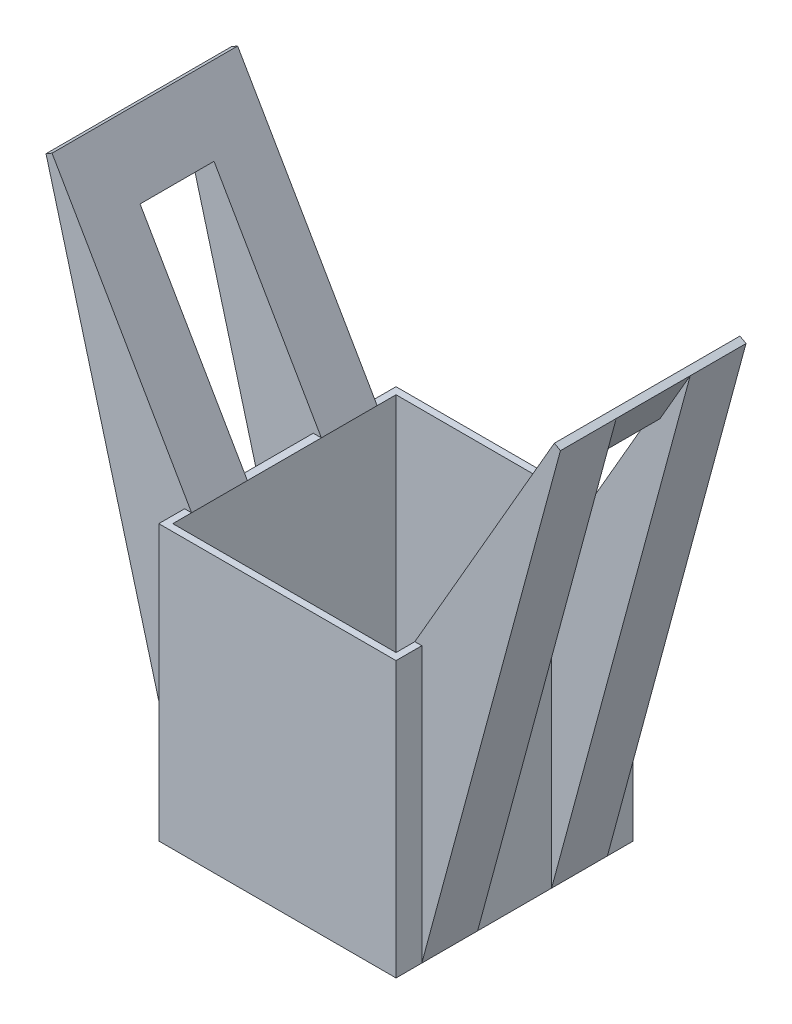
ISO-10303-21;
HEADER;
FILE_DESCRIPTION(('STEP AP214'),'2;1');
FILE_NAME('part.step','',(''),(''),'','','');
FILE_SCHEMA(('AUTOMOTIVE_DESIGN { 1 0 10303 214 1 1 1 1 }'));
ENDSEC;
DATA;
#1=APPLICATION_CONTEXT('core data for automotive mechanical design processes');
#2=APPLICATION_PROTOCOL_DEFINITION('international standard','automotive_design',2000,#1);
#3=PRODUCT_CONTEXT('',#1,'mechanical');
#4=PRODUCT('Part','Part','',(#3));
#5=PRODUCT_RELATED_PRODUCT_CATEGORY('part','',(#4));
#6=PRODUCT_DEFINITION_FORMATION('','',#4);
#7=PRODUCT_DEFINITION_CONTEXT('part definition',#1,'design');
#8=PRODUCT_DEFINITION('design','',#6,#7);
#9=PRODUCT_DEFINITION_SHAPE('','',#8);
#10=(LENGTH_UNIT() NAMED_UNIT(*) SI_UNIT(.MILLI.,.METRE.));
#11=(NAMED_UNIT(*) PLANE_ANGLE_UNIT() SI_UNIT($,.RADIAN.));
#12=(NAMED_UNIT(*) SI_UNIT($,.STERADIAN.) SOLID_ANGLE_UNIT());
#13=UNCERTAINTY_MEASURE_WITH_UNIT(LENGTH_MEASURE(1.E-05),#10,'distance_accuracy_value','');
#14=(GEOMETRIC_REPRESENTATION_CONTEXT(3) GLOBAL_UNCERTAINTY_ASSIGNED_CONTEXT((#13)) GLOBAL_UNIT_ASSIGNED_CONTEXT((#10,
#11,#12)) REPRESENTATION_CONTEXT('',''));
#15=CARTESIAN_POINT('',(0.,0.,0.));
#16=DIRECTION('',(0.,0.,1.));
#17=DIRECTION('',(1.,0.,0.));
#18=AXIS2_PLACEMENT_3D('',#15,#16,#17);
#19=CARTESIAN_POINT('',(2.0973375253844,1.21089838486217,0.));
#20=DIRECTION('',(-0.866025403784442,-0.499999999999995,0.));
#21=DIRECTION('',(-0.499999999999995,0.866025403784442,0.));
#22=AXIS2_PLACEMENT_3D('',#19,#20,#21);
#23=PLANE('',#22);
#24=DIRECTION('',(0.,0.,1.));
#25=VECTOR('',#24,1.);
#26=CARTESIAN_POINT('',(-18.4330127018921,36.7705080756888,-6.64805272018388));
#27=LINE('',#26,#25);
#28=CARTESIAN_POINT('',(-18.4330127018921,36.7705080756888,-2.64805272018388));
#29=VERTEX_POINT('',#28);
#30=CARTESIAN_POINT('',(-18.4330127018921,36.7705080756888,2.65194727981612));
#31=VERTEX_POINT('',#30);
#32=EDGE_CURVE('E253',#29,#31,#27,.T.);
#33=ORIENTED_EDGE('',*,*,#32,.F.);
#34=DIRECTION('',(0.499999999999995,-0.866025403784442,0.));
#35=VECTOR('',#34,1.);
#36=CARTESIAN_POINT('',(2.0973375253844,1.21089838486217,-2.64805272018388));
#37=LINE('',#36,#35);
#38=CARTESIAN_POINT('',(-16.267949192431,33.0205080756888,-2.64805272018388));
#39=VERTEX_POINT('',#38);
#40=EDGE_CURVE('E507',#29,#39,#37,.T.);
#41=ORIENTED_EDGE('',*,*,#40,.T.);
#42=DIRECTION('',(0.,0.,1.));
#43=VECTOR('',#42,1.);
#44=CARTESIAN_POINT('',(-16.267949192431,33.0205080756888,0.));
#45=LINE('',#44,#43);
#46=CARTESIAN_POINT('',(-16.267949192431,33.0205080756888,2.65194727981612));
#47=VERTEX_POINT('',#46);
#48=EDGE_CURVE('E485',#39,#47,#45,.T.);
#49=ORIENTED_EDGE('',*,*,#48,.T.);
#50=DIRECTION('',(-0.499999999999995,0.866025403784442,0.));
#51=VECTOR('',#50,1.);
#52=CARTESIAN_POINT('',(2.0973375253844,1.21089838486217,2.65194727981612));
#53=LINE('',#52,#51);
#54=EDGE_CURVE('E494',#47,#31,#53,.T.);
#55=ORIENTED_EDGE('',*,*,#54,.T.);
#56=EDGE_LOOP('',(#33,#41,#49,#55));
#57=FACE_BOUND('',#56,.T.);
#58=ADVANCED_FACE('F35',(#57),#23,.T.);
#59=DIRECTION('',(0.,0.,-1.));
#60=VECTOR('',#59,1.);
#61=CARTESIAN_POINT('',(-8.57735026918962,19.7,0.));
#62=LINE('',#61,#60);
#63=CARTESIAN_POINT('',(-8.57735026918962,19.7,2.65194727981612));
#64=VERTEX_POINT('',#63);
#65=CARTESIAN_POINT('',(-8.57735026918962,19.7,-2.64805272018388));
#66=VERTEX_POINT('',#65);
#67=EDGE_CURVE('E481',#64,#66,#62,.T.);
#68=ORIENTED_EDGE('',*,*,#67,.T.);
#69=CARTESIAN_POINT('',(-8.5,19.5660254037844,-2.64805272018388));
#70=VERTEX_POINT('',#69);
#71=EDGE_CURVE('E510',#66,#70,#37,.T.);
#72=ORIENTED_EDGE('',*,*,#71,.T.);
#73=DIRECTION('',(0.,0.,-1.));
#74=VECTOR('',#73,1.);
#75=CARTESIAN_POINT('',(-8.5,19.5660254037844,8.5));
#76=LINE('',#75,#74);
#77=CARTESIAN_POINT('',(-8.5,19.5660254037844,2.65194727981612));
#78=VERTEX_POINT('',#77);
#79=EDGE_CURVE('E448',#78,#70,#76,.T.);
#80=ORIENTED_EDGE('',*,*,#79,.F.);
#81=EDGE_CURVE('E472',#78,#64,#53,.T.);
#82=ORIENTED_EDGE('',*,*,#81,.T.);
#83=EDGE_LOOP('',(#68,#72,#80,#82));
#84=FACE_BOUND('',#83,.T.);
#85=ADVANCED_FACE('F560',(#84),#23,.T.);
#86=CARTESIAN_POINT('',(-8.5,19.7,8.5));
#87=DIRECTION('',(1.,0.,0.));
#88=DIRECTION('',(0.,0.,-1.));
#89=AXIS2_PLACEMENT_3D('',#86,#87,#88);
#90=PLANE('',#89);
#91=DIRECTION('',(0.,-1.,0.));
#92=VECTOR('',#91,1.);
#93=CARTESIAN_POINT('',(-8.5,19.7,-2.64805272018388));
#94=LINE('',#93,#92);
#95=CARTESIAN_POINT('',(-8.5,0.,-2.64805272018388));
#96=VERTEX_POINT('',#95);
#97=EDGE_CURVE('E513',#70,#96,#94,.T.);
#98=ORIENTED_EDGE('',*,*,#97,.T.);
#99=DIRECTION('',(0.,0.,1.));
#100=VECTOR('',#99,1.);
#101=CARTESIAN_POINT('',(-8.5,0.,8.5));
#102=LINE('',#101,#100);
#103=CARTESIAN_POINT('',(-8.5,0.,2.65194727981612));
#104=VERTEX_POINT('',#103);
#105=EDGE_CURVE('E425',#96,#104,#102,.T.);
#106=ORIENTED_EDGE('',*,*,#105,.T.);
#107=DIRECTION('',(0.,1.,0.));
#108=VECTOR('',#107,1.);
#109=CARTESIAN_POINT('',(-8.5,0.,2.65194727981612));
#110=LINE('',#109,#108);
#111=EDGE_CURVE('E498',#104,#78,#110,.T.);
#112=ORIENTED_EDGE('',*,*,#111,.T.);
#113=ORIENTED_EDGE('',*,*,#79,.T.);
#114=EDGE_LOOP('',(#98,#106,#112,#113));
#115=FACE_BOUND('',#114,.T.);
#116=ADVANCED_FACE('F519',(#115),#90,.F.);
#117=CARTESIAN_POINT('',(-8.5,0.,-8.5));
#118=VERTEX_POINT('',#117);
#119=CARTESIAN_POINT('',(-8.5,0.,-6.64805272018389));
#120=VERTEX_POINT('',#119);
#121=EDGE_CURVE('E402',#118,#120,#102,.T.);
#122=ORIENTED_EDGE('',*,*,#121,.T.);
#123=DIRECTION('',(0.,1.,0.));
#124=VECTOR('',#123,1.);
#125=CARTESIAN_POINT('',(-8.5,19.7,-6.64805272018388));
#126=LINE('',#125,#124);
#127=CARTESIAN_POINT('',(-8.5,19.7,-6.64805272018388));
#128=VERTEX_POINT('',#127);
#129=EDGE_CURVE('E260',#120,#128,#126,.T.);
#130=ORIENTED_EDGE('',*,*,#129,.T.);
#131=DIRECTION('',(0.,0.,1.));
#132=VECTOR('',#131,1.);
#133=CARTESIAN_POINT('',(-8.5,19.7,8.5));
#134=LINE('',#133,#132);
#135=CARTESIAN_POINT('',(-8.5,19.7,-8.5));
#136=VERTEX_POINT('',#135);
#137=EDGE_CURVE('E409',#136,#128,#134,.T.);
#138=ORIENTED_EDGE('',*,*,#137,.F.);
#139=DIRECTION('',(0.,-1.,0.));
#140=VECTOR('',#139,1.);
#141=CARTESIAN_POINT('',(-8.5,19.7,-8.5));
#142=LINE('',#141,#140);
#143=EDGE_CURVE('E428',#136,#118,#142,.T.);
#144=ORIENTED_EDGE('',*,*,#143,.T.);
#145=EDGE_LOOP('',(#122,#130,#138,#144));
#146=FACE_BOUND('',#145,.T.);
#147=ADVANCED_FACE('F584',(#146),#90,.F.);
#148=CARTESIAN_POINT('',(2.53035022727662,1.46089838486217,0.));
#149=DIRECTION('',(-0.866025403784442,-0.499999999999995,0.));
#150=DIRECTION('',(-0.499999999999995,0.866025403784442,0.));
#151=AXIS2_PLACEMENT_3D('',#148,#149,#150);
#152=PLANE('',#151);
#153=DIRECTION('',(-0.499999999999995,0.866025403784442,0.));
#154=VECTOR('',#153,1.);
#155=CARTESIAN_POINT('',(2.53035022727662,1.46089838486217,-2.64805272018388));
#156=LINE('',#155,#154);
#157=CARTESIAN_POINT('',(-8.,19.7,-2.64805272018388));
#158=VERTEX_POINT('',#157);
#159=CARTESIAN_POINT('',(-15.6905989232414,33.0205080756888,-2.64805272018388));
#160=VERTEX_POINT('',#159);
#161=EDGE_CURVE('E11',#158,#160,#156,.T.);
#162=ORIENTED_EDGE('',*,*,#161,.F.);
#163=DIRECTION('',(0.,0.,-1.));
#164=VECTOR('',#163,1.);
#165=CARTESIAN_POINT('',(-8.,19.7,-6.64805272018388));
#166=LINE('',#165,#164);
#167=CARTESIAN_POINT('',(-8.,19.7,-6.64805272018388));
#168=VERTEX_POINT('',#167);
#169=EDGE_CURVE('E468',#158,#168,#166,.T.);
#170=ORIENTED_EDGE('',*,*,#169,.T.);
#171=DIRECTION('',(-0.499999999999995,0.866025403784442,0.));
#172=VECTOR('',#171,1.);
#173=CARTESIAN_POINT('',(-8.,19.7,-6.64805272018388));
#174=LINE('',#173,#172);
#175=CARTESIAN_POINT('',(-17.9999999999999,37.0205080756888,-6.64805272018388));
#176=VERTEX_POINT('',#175);
#177=EDGE_CURVE('E479',#168,#176,#174,.T.);
#178=ORIENTED_EDGE('',*,*,#177,.T.);
#179=DIRECTION('',(0.,0.,1.));
#180=VECTOR('',#179,1.);
#181=CARTESIAN_POINT('',(-17.9999999999999,37.0205080756888,-6.64805272018388));
#182=LINE('',#181,#180);
#183=CARTESIAN_POINT('',(-17.9999999999999,37.0205080756888,6.65194727981612));
#184=VERTEX_POINT('',#183);
#185=EDGE_CURVE('E266',#176,#184,#182,.T.);
#186=ORIENTED_EDGE('',*,*,#185,.T.);
#187=DIRECTION('',(0.499999999999995,-0.866025403784442,0.));
#188=VECTOR('',#187,1.);
#189=CARTESIAN_POINT('',(-8.,19.7,6.65194727981612));
#190=LINE('',#189,#188);
#191=CARTESIAN_POINT('',(-8.,19.7,6.65194727981612));
#192=VERTEX_POINT('',#191);
#193=EDGE_CURVE('E476',#184,#192,#190,.T.);
#194=ORIENTED_EDGE('',*,*,#193,.T.);
#195=CARTESIAN_POINT('',(-8.,19.7,2.65194727981611));
#196=VERTEX_POINT('',#195);
#197=EDGE_CURVE('E467',#192,#196,#166,.T.);
#198=ORIENTED_EDGE('',*,*,#197,.T.);
#199=DIRECTION('',(0.499999999999995,-0.866025403784442,0.));
#200=VECTOR('',#199,1.);
#201=CARTESIAN_POINT('',(2.53035022727662,1.46089838486217,2.65194727981612));
#202=LINE('',#201,#200);
#203=CARTESIAN_POINT('',(-15.6905989232414,33.0205080756888,2.65194727981612));
#204=VERTEX_POINT('',#203);
#205=EDGE_CURVE('E43',#204,#196,#202,.T.);
#206=ORIENTED_EDGE('',*,*,#205,.F.);
#207=DIRECTION('',(0.,0.,1.));
#208=VECTOR('',#207,1.);
#209=CARTESIAN_POINT('',(-15.6905989232414,33.0205080756888,0.));
#210=LINE('',#209,#208);
#211=EDGE_CURVE('E451',#160,#204,#210,.T.);
#212=ORIENTED_EDGE('',*,*,#211,.F.);
#213=EDGE_LOOP('',(#162,#170,#178,#186,#194,#198,#206,#212));
#214=FACE_BOUND('',#213,.T.);
#215=ADVANCED_FACE('F474',(#214),#152,.F.);
#216=CARTESIAN_POINT('',(0.,19.7,0.));
#217=DIRECTION('',(0.,-1.,0.));
#218=DIRECTION('',(0.,0.,-1.));
#219=AXIS2_PLACEMENT_3D('',#216,#217,#218);
#220=PLANE('',#219);
#221=ORIENTED_EDGE('',*,*,#137,.T.);
#222=DIRECTION('',(1.,0.,0.));
#223=VECTOR('',#222,1.);
#224=CARTESIAN_POINT('',(0.,19.7,-6.64805272018388));
#225=LINE('',#224,#223);
#226=EDGE_CURVE('E279',#128,#168,#225,.T.);
#227=ORIENTED_EDGE('',*,*,#226,.T.);
#228=DIRECTION('',(0.,0.,1.));
#229=VECTOR('',#228,1.);
#230=CARTESIAN_POINT('',(-8.,19.7,8.));
#231=LINE('',#230,#229);
#232=CARTESIAN_POINT('',(-8.,19.7,-8.));
#233=VERTEX_POINT('',#232);
#234=EDGE_CURVE('E364',#233,#168,#231,.T.);
#235=ORIENTED_EDGE('',*,*,#234,.F.);
#236=DIRECTION('',(-1.,0.,0.));
#237=VECTOR('',#236,1.);
#238=CARTESIAN_POINT('',(8.,19.7,-8.));
#239=LINE('',#238,#237);
#240=CARTESIAN_POINT('',(8.,19.7,-8.));
#241=VERTEX_POINT('',#240);
#242=EDGE_CURVE('E374',#241,#233,#239,.T.);
#243=ORIENTED_EDGE('',*,*,#242,.F.);
#244=DIRECTION('',(0.,0.,-1.));
#245=VECTOR('',#244,1.);
#246=CARTESIAN_POINT('',(8.,19.7,8.));
#247=LINE('',#246,#245);
#248=CARTESIAN_POINT('',(8.,19.7,-6.64805272018388));
#249=VERTEX_POINT('',#248);
#250=EDGE_CURVE('E370',#249,#241,#247,.T.);
#251=ORIENTED_EDGE('',*,*,#250,.F.);
#252=DIRECTION('',(-1.,0.,0.));
#253=VECTOR('',#252,1.);
#254=CARTESIAN_POINT('',(0.,19.7,-6.64805272018388));
#255=LINE('',#254,#253);
#256=CARTESIAN_POINT('',(8.5,19.7,-6.64805272018388));
#257=VERTEX_POINT('',#256);
#258=EDGE_CURVE('E360',#257,#249,#255,.T.);
#259=ORIENTED_EDGE('',*,*,#258,.F.);
#260=DIRECTION('',(0.,0.,-1.));
#261=VECTOR('',#260,1.);
#262=CARTESIAN_POINT('',(8.5,19.7,8.5));
#263=LINE('',#262,#261);
#264=CARTESIAN_POINT('',(8.5,19.7,-8.5));
#265=VERTEX_POINT('',#264);
#266=EDGE_CURVE('E401',#257,#265,#263,.T.);
#267=ORIENTED_EDGE('',*,*,#266,.T.);
#268=DIRECTION('',(-1.,0.,0.));
#269=VECTOR('',#268,1.);
#270=CARTESIAN_POINT('',(8.5,19.7,-8.5));
#271=LINE('',#270,#269);
#272=EDGE_CURVE('E406',#265,#136,#271,.T.);
#273=ORIENTED_EDGE('',*,*,#272,.T.);
#274=EDGE_LOOP('',(#221,#227,#235,#243,#251,#259,#267,#273));
#275=FACE_BOUND('',#274,.T.);
#276=ADVANCED_FACE('F583',(#275),#220,.F.);
#277=CARTESIAN_POINT('',(8.5,19.7,8.5));
#278=DIRECTION('',(-1.,0.,0.));
#279=DIRECTION('',(0.,0.,1.));
#280=AXIS2_PLACEMENT_3D('',#277,#278,#279);
#281=PLANE('',#280);
#282=DIRECTION('',(0.,-1.,0.));
#283=VECTOR('',#282,1.);
#284=CARTESIAN_POINT('',(8.5,19.7,-2.64805272018388));
#285=LINE('',#284,#283);
#286=CARTESIAN_POINT('',(8.5,19.5660254037844,-2.64805272018388));
#287=VERTEX_POINT('',#286);
#288=CARTESIAN_POINT('',(8.5,0.,-2.64805272018388));
#289=VERTEX_POINT('',#288);
#290=EDGE_CURVE('E286',#287,#289,#285,.T.);
#291=ORIENTED_EDGE('',*,*,#290,.F.);
#292=DIRECTION('',(0.,0.,1.));
#293=VECTOR('',#292,1.);
#294=CARTESIAN_POINT('',(8.5,19.5660254037844,8.5));
#295=LINE('',#294,#293);
#296=CARTESIAN_POINT('',(8.5,19.5660254037844,2.65194727981612));
#297=VERTEX_POINT('',#296);
#298=EDGE_CURVE('E437',#287,#297,#295,.T.);
#299=ORIENTED_EDGE('',*,*,#298,.T.);
#300=DIRECTION('',(0.,1.,0.));
#301=VECTOR('',#300,1.);
#302=CARTESIAN_POINT('',(8.5,0.,2.65194727981612));
#303=LINE('',#302,#301);
#304=CARTESIAN_POINT('',(8.5,0.,2.65194727981612));
#305=VERTEX_POINT('',#304);
#306=EDGE_CURVE('E301',#305,#297,#303,.T.);
#307=ORIENTED_EDGE('',*,*,#306,.F.);
#308=DIRECTION('',(0.,0.,-1.));
#309=VECTOR('',#308,1.);
#310=CARTESIAN_POINT('',(8.5,0.,8.5));
#311=LINE('',#310,#309);
#312=EDGE_CURVE('E420',#305,#289,#311,.T.);
#313=ORIENTED_EDGE('',*,*,#312,.T.);
#314=EDGE_LOOP('',(#291,#299,#307,#313));
#315=FACE_BOUND('',#314,.T.);
#316=ADVANCED_FACE('F620',(#315),#281,.F.);
#317=CARTESIAN_POINT('',(-2.0973375253844,1.21089838486217,0.));
#318=DIRECTION('',(0.866025403784442,-0.499999999999995,0.));
#319=DIRECTION('',(0.499999999999995,0.866025403784442,0.));
#320=AXIS2_PLACEMENT_3D('',#317,#318,#319);
#321=PLANE('',#320);
#322=ORIENTED_EDGE('',*,*,#298,.F.);
#323=DIRECTION('',(0.499999999999995,0.866025403784442,0.));
#324=VECTOR('',#323,1.);
#325=CARTESIAN_POINT('',(-2.0973375253844,1.21089838486217,-2.64805272018388));
#326=LINE('',#325,#324);
#327=CARTESIAN_POINT('',(8.57735026918962,19.7,-2.64805272018388));
#328=VERTEX_POINT('',#327);
#329=EDGE_CURVE('E295',#287,#328,#326,.T.);
#330=ORIENTED_EDGE('',*,*,#329,.T.);
#331=DIRECTION('',(0.,0.,-1.));
#332=VECTOR('',#331,1.);
#333=CARTESIAN_POINT('',(8.57735026918962,19.7,0.));
#334=LINE('',#333,#332);
#335=CARTESIAN_POINT('',(8.57735026918962,19.7,2.65194727981612));
#336=VERTEX_POINT('',#335);
#337=EDGE_CURVE('E322',#336,#328,#334,.T.);
#338=ORIENTED_EDGE('',*,*,#337,.F.);
#339=DIRECTION('',(-0.499999999999995,-0.866025403784442,0.));
#340=VECTOR('',#339,1.);
#341=CARTESIAN_POINT('',(-2.0973375253844,1.21089838486217,2.65194727981612));
#342=LINE('',#341,#340);
#343=EDGE_CURVE('E312',#336,#297,#342,.T.);
#344=ORIENTED_EDGE('',*,*,#343,.T.);
#345=EDGE_LOOP('',(#322,#330,#338,#344));
#346=FACE_BOUND('',#345,.T.);
#347=ADVANCED_FACE('F616',(#346),#321,.T.);
#348=DIRECTION('',(0.,0.,1.));
#349=VECTOR('',#348,1.);
#350=CARTESIAN_POINT('',(16.267949192431,33.0205080756888,0.));
#351=LINE('',#350,#349);
#352=CARTESIAN_POINT('',(16.267949192431,33.0205080756888,-2.64805272018388));
#353=VERTEX_POINT('',#352);
#354=CARTESIAN_POINT('',(16.2679491924311,33.0205080756888,2.65194727981612));
#355=VERTEX_POINT('',#354);
#356=EDGE_CURVE('E330',#353,#355,#351,.T.);
#357=ORIENTED_EDGE('',*,*,#356,.F.);
#358=CARTESIAN_POINT('',(18.4330127018921,36.7705080756888,-2.64805272018388));
#359=VERTEX_POINT('',#358);
#360=EDGE_CURVE('E294',#353,#359,#326,.T.);
#361=ORIENTED_EDGE('',*,*,#360,.T.);
#362=DIRECTION('',(0.,0.,1.));
#363=VECTOR('',#362,1.);
#364=CARTESIAN_POINT('',(18.4330127018921,36.7705080756888,-6.64805272018388));
#365=LINE('',#364,#363);
#366=CARTESIAN_POINT('',(18.4330127018921,36.7705080756888,2.65194727981612));
#367=VERTEX_POINT('',#366);
#368=EDGE_CURVE('E338',#359,#367,#365,.T.);
#369=ORIENTED_EDGE('',*,*,#368,.T.);
#370=EDGE_CURVE('E315',#367,#355,#342,.T.);
#371=ORIENTED_EDGE('',*,*,#370,.T.);
#372=EDGE_LOOP('',(#357,#361,#369,#371));
#373=FACE_BOUND('',#372,.T.);
#374=ADVANCED_FACE('F619',(#373),#321,.T.);
#375=DIRECTION('',(0.,1.,0.));
#376=VECTOR('',#375,1.);
#377=CARTESIAN_POINT('',(8.5,19.7,-6.64805272018388));
#378=LINE('',#377,#376);
#379=CARTESIAN_POINT('',(8.5,0.,-6.64805272018389));
#380=VERTEX_POINT('',#379);
#381=EDGE_CURVE('E358',#380,#257,#378,.T.);
#382=ORIENTED_EDGE('',*,*,#381,.F.);
#383=CARTESIAN_POINT('',(8.5,0.,-8.5));
#384=VERTEX_POINT('',#383);
#385=EDGE_CURVE('E415',#380,#384,#311,.T.);
#386=ORIENTED_EDGE('',*,*,#385,.T.);
#387=DIRECTION('',(0.,-1.,0.));
#388=VECTOR('',#387,1.);
#389=CARTESIAN_POINT('',(8.5,19.7,-8.5));
#390=LINE('',#389,#388);
#391=EDGE_CURVE('E431',#265,#384,#390,.T.);
#392=ORIENTED_EDGE('',*,*,#391,.F.);
#393=ORIENTED_EDGE('',*,*,#266,.F.);
#394=EDGE_LOOP('',(#382,#386,#392,#393));
#395=FACE_BOUND('',#394,.T.);
#396=ADVANCED_FACE('F653',(#395),#281,.F.);
#397=CARTESIAN_POINT('',(-8.,19.7,8.));
#398=VERTEX_POINT('',#397);
#399=EDGE_CURVE('E368',#192,#398,#231,.T.);
#400=ORIENTED_EDGE('',*,*,#399,.F.);
#401=DIRECTION('',(-1.,0.,0.));
#402=VECTOR('',#401,1.);
#403=CARTESIAN_POINT('',(0.,19.7,6.65194727981612));
#404=LINE('',#403,#402);
#405=CARTESIAN_POINT('',(-8.5,19.7,6.65194727981612));
#406=VERTEX_POINT('',#405);
#407=EDGE_CURVE('E275',#192,#406,#404,.T.);
#408=ORIENTED_EDGE('',*,*,#407,.T.);
#409=CARTESIAN_POINT('',(-8.5,19.7,8.5));
#410=VERTEX_POINT('',#409);
#411=EDGE_CURVE('E408',#406,#410,#134,.T.);
#412=ORIENTED_EDGE('',*,*,#411,.T.);
#413=DIRECTION('',(1.,0.,0.));
#414=VECTOR('',#413,1.);
#415=CARTESIAN_POINT('',(8.5,19.7,8.5));
#416=LINE('',#415,#414);
#417=CARTESIAN_POINT('',(8.5,19.7,8.5));
#418=VERTEX_POINT('',#417);
#419=EDGE_CURVE('E398',#410,#418,#416,.T.);
#420=ORIENTED_EDGE('',*,*,#419,.T.);
#421=CARTESIAN_POINT('',(8.5,19.7,6.65194727981612));
#422=VERTEX_POINT('',#421);
#423=EDGE_CURVE('E403',#418,#422,#263,.T.);
#424=ORIENTED_EDGE('',*,*,#423,.T.);
#425=DIRECTION('',(1.,0.,0.));
#426=VECTOR('',#425,1.);
#427=CARTESIAN_POINT('',(0.,19.7,6.65194727981612));
#428=LINE('',#427,#426);
#429=CARTESIAN_POINT('',(8.,19.7,6.65194727981612));
#430=VERTEX_POINT('',#429);
#431=EDGE_CURVE('E356',#430,#422,#428,.T.);
#432=ORIENTED_EDGE('',*,*,#431,.F.);
#433=CARTESIAN_POINT('',(8.,19.7,8.));
#434=VERTEX_POINT('',#433);
#435=EDGE_CURVE('E371',#434,#430,#247,.T.);
#436=ORIENTED_EDGE('',*,*,#435,.F.);
#437=DIRECTION('',(1.,0.,0.));
#438=VECTOR('',#437,1.);
#439=CARTESIAN_POINT('',(8.,19.7,8.));
#440=LINE('',#439,#438);
#441=EDGE_CURVE('E367',#398,#434,#440,.T.);
#442=ORIENTED_EDGE('',*,*,#441,.F.);
#443=EDGE_LOOP('',(#400,#408,#412,#420,#424,#432,#436,#442));
#444=FACE_BOUND('',#443,.T.);
#445=ADVANCED_FACE('F546',(#444),#220,.F.);
#446=CARTESIAN_POINT('',(8.5,0.,8.5));
#447=VERTEX_POINT('',#446);
#448=CARTESIAN_POINT('',(8.5,0.,6.65194727981612));
#449=VERTEX_POINT('',#448);
#450=EDGE_CURVE('E416',#447,#449,#311,.T.);
#451=ORIENTED_EDGE('',*,*,#450,.T.);
#452=DIRECTION('',(0.,-1.,0.));
#453=VECTOR('',#452,1.);
#454=CARTESIAN_POINT('',(8.5,19.7,6.65194727981612));
#455=LINE('',#454,#453);
#456=EDGE_CURVE('E354',#422,#449,#455,.T.);
#457=ORIENTED_EDGE('',*,*,#456,.F.);
#458=ORIENTED_EDGE('',*,*,#423,.F.);
#459=DIRECTION('',(0.,-1.,0.));
#460=VECTOR('',#459,1.);
#461=CARTESIAN_POINT('',(8.5,19.7,8.5));
#462=LINE('',#461,#460);
#463=EDGE_CURVE('E434',#418,#447,#462,.T.);
#464=ORIENTED_EDGE('',*,*,#463,.T.);
#465=EDGE_LOOP('',(#451,#457,#458,#464));
#466=FACE_BOUND('',#465,.T.);
#467=ADVANCED_FACE('F542',(#466),#281,.F.);
#468=CARTESIAN_POINT('',(0.,0.,0.));
#469=DIRECTION('',(0.,-1.,0.));
#470=DIRECTION('',(0.,0.,-1.));
#471=AXIS2_PLACEMENT_3D('',#468,#469,#470);
#472=PLANE('',#471);
#473=DIRECTION('',(1.,0.,0.));
#474=VECTOR('',#473,1.);
#475=CARTESIAN_POINT('',(8.5,0.,8.5));
#476=LINE('',#475,#474);
#477=CARTESIAN_POINT('',(-8.5,0.,8.5));
#478=VERTEX_POINT('',#477);
#479=EDGE_CURVE('E397',#478,#447,#476,.T.);
#480=ORIENTED_EDGE('',*,*,#479,.F.);
#481=CARTESIAN_POINT('',(-8.5,0.,6.65194727981612));
#482=VERTEX_POINT('',#481);
#483=EDGE_CURVE('E422',#482,#478,#102,.T.);
#484=ORIENTED_EDGE('',*,*,#483,.F.);
#485=DIRECTION('',(0.,0.,1.));
#486=VECTOR('',#485,1.);
#487=CARTESIAN_POINT('',(-8.5,0.,-35.4365681215519));
#488=LINE('',#487,#486);
#489=EDGE_CURVE('E499',#104,#482,#488,.T.);
#490=ORIENTED_EDGE('',*,*,#489,.F.);
#491=ORIENTED_EDGE('',*,*,#105,.F.);
#492=DIRECTION('',(0.,0.,-1.));
#493=VECTOR('',#492,1.);
#494=CARTESIAN_POINT('',(-8.5,0.,35.4404626811841));
#495=LINE('',#494,#493);
#496=EDGE_CURVE('E261',#96,#120,#495,.T.);
#497=ORIENTED_EDGE('',*,*,#496,.T.);
#498=ORIENTED_EDGE('',*,*,#121,.F.);
#499=DIRECTION('',(-1.,0.,0.));
#500=VECTOR('',#499,1.);
#501=CARTESIAN_POINT('',(8.5,0.,-8.5));
#502=LINE('',#501,#500);
#503=EDGE_CURVE('E419',#384,#118,#502,.T.);
#504=ORIENTED_EDGE('',*,*,#503,.F.);
#505=ORIENTED_EDGE('',*,*,#385,.F.);
#506=DIRECTION('',(0.,0.,-1.));
#507=VECTOR('',#506,1.);
#508=CARTESIAN_POINT('',(8.5,0.,35.4404626811841));
#509=LINE('',#508,#507);
#510=EDGE_CURVE('E287',#289,#380,#509,.T.);
#511=ORIENTED_EDGE('',*,*,#510,.F.);
#512=ORIENTED_EDGE('',*,*,#312,.F.);
#513=DIRECTION('',(0.,0.,1.));
#514=VECTOR('',#513,1.);
#515=CARTESIAN_POINT('',(8.5,0.,-35.4365681215519));
#516=LINE('',#515,#514);
#517=EDGE_CURVE('E305',#305,#449,#516,.T.);
#518=ORIENTED_EDGE('',*,*,#517,.T.);
#519=ORIENTED_EDGE('',*,*,#450,.F.);
#520=EDGE_LOOP('',(#480,#484,#490,#491,#497,#498,#504,#505,#511,#512,#518,#519));
#521=FACE_BOUND('',#520,.T.);
#522=DIRECTION('',(-1.,0.,0.));
#523=VECTOR('',#522,1.);
#524=CARTESIAN_POINT('',(8.,0.,-8.));
#525=LINE('',#524,#523);
#526=CARTESIAN_POINT('',(8.,0.,-8.));
#527=VERTEX_POINT('',#526);
#528=CARTESIAN_POINT('',(-8.,0.,-8.));
#529=VERTEX_POINT('',#528);
#530=EDGE_CURVE('E385',#527,#529,#525,.T.);
#531=ORIENTED_EDGE('',*,*,#530,.T.);
#532=DIRECTION('',(0.,0.,1.));
#533=VECTOR('',#532,1.);
#534=CARTESIAN_POINT('',(-8.,0.,8.));
#535=LINE('',#534,#533);
#536=CARTESIAN_POINT('',(-8.,0.,8.));
#537=VERTEX_POINT('',#536);
#538=EDGE_CURVE('E363',#529,#537,#535,.T.);
#539=ORIENTED_EDGE('',*,*,#538,.T.);
#540=DIRECTION('',(1.,0.,0.));
#541=VECTOR('',#540,1.);
#542=CARTESIAN_POINT('',(8.,0.,8.));
#543=LINE('',#542,#541);
#544=CARTESIAN_POINT('',(8.,0.,8.));
#545=VERTEX_POINT('',#544);
#546=EDGE_CURVE('E379',#537,#545,#543,.T.);
#547=ORIENTED_EDGE('',*,*,#546,.T.);
#548=DIRECTION('',(0.,0.,-1.));
#549=VECTOR('',#548,1.);
#550=CARTESIAN_POINT('',(8.,0.,8.));
#551=LINE('',#550,#549);
#552=EDGE_CURVE('E382',#545,#527,#551,.T.);
#553=ORIENTED_EDGE('',*,*,#552,.T.);
#554=EDGE_LOOP('',(#531,#539,#547,#553));
#555=FACE_BOUND('',#554,.T.);
#556=ADVANCED_FACE('F526',(#521,#555),#472,.T.);
#557=CARTESIAN_POINT('',(8.5,19.7,8.5));
#558=DIRECTION('',(0.,0.,-1.));
#559=DIRECTION('',(-1.,0.,0.));
#560=AXIS2_PLACEMENT_3D('',#557,#558,#559);
#561=PLANE('',#560);
#562=ORIENTED_EDGE('',*,*,#479,.T.);
#563=ORIENTED_EDGE('',*,*,#463,.F.);
#564=ORIENTED_EDGE('',*,*,#419,.F.);
#565=DIRECTION('',(0.,-1.,0.));
#566=VECTOR('',#565,1.);
#567=CARTESIAN_POINT('',(-8.5,19.7,8.5));
#568=LINE('',#567,#566);
#569=EDGE_CURVE('E412',#410,#478,#568,.T.);
#570=ORIENTED_EDGE('',*,*,#569,.T.);
#571=EDGE_LOOP('',(#562,#563,#564,#570));
#572=FACE_BOUND('',#571,.T.);
#573=ADVANCED_FACE('F37',(#572),#561,.F.);
#574=CARTESIAN_POINT('',(8.5,19.7,-8.5));
#575=DIRECTION('',(0.,0.,1.));
#576=DIRECTION('',(1.,0.,0.));
#577=AXIS2_PLACEMENT_3D('',#574,#575,#576);
#578=PLANE('',#577);
#579=ORIENTED_EDGE('',*,*,#503,.T.);
#580=ORIENTED_EDGE('',*,*,#143,.F.);
#581=ORIENTED_EDGE('',*,*,#272,.F.);
#582=ORIENTED_EDGE('',*,*,#391,.T.);
#583=EDGE_LOOP('',(#579,#580,#581,#582));
#584=FACE_BOUND('',#583,.T.);
#585=ADVANCED_FACE('F658',(#584),#578,.F.);
#586=DIRECTION('',(0.,-1.,0.));
#587=VECTOR('',#586,1.);
#588=CARTESIAN_POINT('',(-8.5,19.7,6.65194727981612));
#589=LINE('',#588,#587);
#590=EDGE_CURVE('E269',#406,#482,#589,.T.);
#591=ORIENTED_EDGE('',*,*,#590,.T.);
#592=ORIENTED_EDGE('',*,*,#483,.T.);
#593=ORIENTED_EDGE('',*,*,#569,.F.);
#594=ORIENTED_EDGE('',*,*,#411,.F.);
#595=EDGE_LOOP('',(#591,#592,#593,#594));
#596=FACE_BOUND('',#595,.T.);
#597=ADVANCED_FACE('F532',(#596),#90,.F.);
#598=CARTESIAN_POINT('',(-8.,19.7,8.));
#599=DIRECTION('',(1.,0.,0.));
#600=DIRECTION('',(0.,0.,-1.));
#601=AXIS2_PLACEMENT_3D('',#598,#599,#600);
#602=PLANE('',#601);
#603=ORIENTED_EDGE('',*,*,#538,.F.);
#604=DIRECTION('',(0.,-1.,0.));
#605=VECTOR('',#604,1.);
#606=CARTESIAN_POINT('',(-8.,19.7,-8.));
#607=LINE('',#606,#605);
#608=EDGE_CURVE('E376',#233,#529,#607,.T.);
#609=ORIENTED_EDGE('',*,*,#608,.F.);
#610=ORIENTED_EDGE('',*,*,#234,.T.);
#611=ORIENTED_EDGE('',*,*,#169,.F.);
#612=DIRECTION('',(0.,0.,1.));
#613=VECTOR('',#612,1.);
#614=CARTESIAN_POINT('',(-8.,19.7,-2.64805272018388));
#615=LINE('',#614,#613);
#616=EDGE_CURVE('E465',#158,#196,#615,.T.);
#617=ORIENTED_EDGE('',*,*,#616,.T.);
#618=ORIENTED_EDGE('',*,*,#197,.F.);
#619=ORIENTED_EDGE('',*,*,#399,.T.);
#620=DIRECTION('',(0.,-1.,0.));
#621=VECTOR('',#620,1.);
#622=CARTESIAN_POINT('',(-8.,19.7,8.));
#623=LINE('',#622,#621);
#624=EDGE_CURVE('E394',#398,#537,#623,.T.);
#625=ORIENTED_EDGE('',*,*,#624,.T.);
#626=EDGE_LOOP('',(#603,#609,#610,#611,#617,#618,#619,#625));
#627=FACE_BOUND('',#626,.T.);
#628=ADVANCED_FACE('F466',(#627),#602,.T.);
#629=CARTESIAN_POINT('',(8.,19.7,8.));
#630=DIRECTION('',(0.,0.,-1.));
#631=DIRECTION('',(-1.,0.,0.));
#632=AXIS2_PLACEMENT_3D('',#629,#630,#631);
#633=PLANE('',#632);
#634=ORIENTED_EDGE('',*,*,#546,.F.);
#635=ORIENTED_EDGE('',*,*,#624,.F.);
#636=ORIENTED_EDGE('',*,*,#441,.T.);
#637=DIRECTION('',(0.,-1.,0.));
#638=VECTOR('',#637,1.);
#639=CARTESIAN_POINT('',(8.,19.7,8.));
#640=LINE('',#639,#638);
#641=EDGE_CURVE('E392',#434,#545,#640,.T.);
#642=ORIENTED_EDGE('',*,*,#641,.T.);
#643=EDGE_LOOP('',(#634,#635,#636,#642));
#644=FACE_BOUND('',#643,.T.);
#645=ADVANCED_FACE('F644',(#644),#633,.T.);
#646=CARTESIAN_POINT('',(8.,19.7,8.));
#647=DIRECTION('',(-1.,0.,0.));
#648=DIRECTION('',(0.,0.,1.));
#649=AXIS2_PLACEMENT_3D('',#646,#647,#648);
#650=PLANE('',#649);
#651=ORIENTED_EDGE('',*,*,#552,.F.);
#652=ORIENTED_EDGE('',*,*,#641,.F.);
#653=ORIENTED_EDGE('',*,*,#435,.T.);
#654=DIRECTION('',(0.,0.,-1.));
#655=VECTOR('',#654,1.);
#656=CARTESIAN_POINT('',(8.,19.7,-6.64805272018388));
#657=LINE('',#656,#655);
#658=CARTESIAN_POINT('',(8.,19.7,2.65194727981612));
#659=VERTEX_POINT('',#658);
#660=EDGE_CURVE('E346',#430,#659,#657,.T.);
#661=ORIENTED_EDGE('',*,*,#660,.T.);
#662=DIRECTION('',(0.,0.,1.));
#663=VECTOR('',#662,1.);
#664=CARTESIAN_POINT('',(8.,19.7,-2.64805272018388));
#665=LINE('',#664,#663);
#666=CARTESIAN_POINT('',(8.,19.7,-2.64805272018389));
#667=VERTEX_POINT('',#666);
#668=EDGE_CURVE('E316',#667,#659,#665,.T.);
#669=ORIENTED_EDGE('',*,*,#668,.F.);
#670=EDGE_CURVE('E345',#667,#249,#657,.T.);
#671=ORIENTED_EDGE('',*,*,#670,.T.);
#672=ORIENTED_EDGE('',*,*,#250,.T.);
#673=DIRECTION('',(0.,-1.,0.));
#674=VECTOR('',#673,1.);
#675=CARTESIAN_POINT('',(8.,19.7,-8.));
#676=LINE('',#675,#674);
#677=EDGE_CURVE('E390',#241,#527,#676,.T.);
#678=ORIENTED_EDGE('',*,*,#677,.T.);
#679=EDGE_LOOP('',(#651,#652,#653,#661,#669,#671,#672,#678));
#680=FACE_BOUND('',#679,.T.);
#681=ADVANCED_FACE('F640',(#680),#650,.T.);
#682=CARTESIAN_POINT('',(8.,19.7,-8.));
#683=DIRECTION('',(0.,0.,1.));
#684=DIRECTION('',(1.,0.,0.));
#685=AXIS2_PLACEMENT_3D('',#682,#683,#684);
#686=PLANE('',#685);
#687=ORIENTED_EDGE('',*,*,#530,.F.);
#688=ORIENTED_EDGE('',*,*,#677,.F.);
#689=ORIENTED_EDGE('',*,*,#242,.T.);
#690=ORIENTED_EDGE('',*,*,#608,.T.);
#691=EDGE_LOOP('',(#687,#688,#689,#690));
#692=FACE_BOUND('',#691,.T.);
#693=ADVANCED_FACE('F636',(#692),#686,.T.);
#694=CARTESIAN_POINT('',(8.43301270189222,19.45,-6.64805272018388));
#695=DIRECTION('',(0.,0.,1.));
#696=DIRECTION('',(0.,-1.,0.));
#697=AXIS2_PLACEMENT_3D('',#694,#695,#696);
#698=PLANE('',#697);
#699=DIRECTION('',(-0.866025403784442,0.499999999999995,0.));
#700=VECTOR('',#699,1.);
#701=CARTESIAN_POINT('',(18.4330127018921,36.7705080756888,-6.64805272018388));
#702=LINE('',#701,#700);
#703=CARTESIAN_POINT('',(18.4330127018921,36.7705080756888,-6.64805272018388));
#704=VERTEX_POINT('',#703);
#705=CARTESIAN_POINT('',(17.9999999999999,37.0205080756888,-6.64805272018388));
#706=VERTEX_POINT('',#705);
#707=EDGE_CURVE('E351',#704,#706,#702,.T.);
#708=ORIENTED_EDGE('',*,*,#707,.F.);
#709=DIRECTION('',(-0.260787604799513,-0.965396201143827,0.));
#710=VECTOR('',#709,1.);
#711=CARTESIAN_POINT('',(8.5,0.,-6.64805272018389));
#712=LINE('',#711,#710);
#713=EDGE_CURVE('E282',#704,#380,#712,.T.);
#714=ORIENTED_EDGE('',*,*,#713,.T.);
#715=ORIENTED_EDGE('',*,*,#381,.T.);
#716=ORIENTED_EDGE('',*,*,#258,.T.);
#717=DIRECTION('',(0.499999999999995,0.866025403784442,0.));
#718=VECTOR('',#717,1.);
#719=CARTESIAN_POINT('',(8.,19.7,-6.64805272018388));
#720=LINE('',#719,#718);
#721=EDGE_CURVE('E333',#249,#706,#720,.T.);
#722=ORIENTED_EDGE('',*,*,#721,.T.);
#723=EDGE_LOOP('',(#708,#714,#715,#716,#722));
#724=FACE_BOUND('',#723,.T.);
#725=ADVANCED_FACE('F629',(#724),#698,.F.);
#726=CARTESIAN_POINT('',(8.43301270189222,19.45,6.65194727981612));
#727=DIRECTION('',(0.,0.,-1.));
#728=DIRECTION('',(0.,1.,0.));
#729=AXIS2_PLACEMENT_3D('',#726,#727,#728);
#730=PLANE('',#729);
#731=ORIENTED_EDGE('',*,*,#431,.T.);
#732=ORIENTED_EDGE('',*,*,#456,.T.);
#733=DIRECTION('',(0.260787604799513,0.965396201143827,0.));
#734=VECTOR('',#733,1.);
#735=CARTESIAN_POINT('',(18.4330127018921,36.7705080756888,6.65194727981612));
#736=LINE('',#735,#734);
#737=CARTESIAN_POINT('',(18.4330127018921,36.7705080756888,6.65194727981612));
#738=VERTEX_POINT('',#737);
#739=EDGE_CURVE('E297',#449,#738,#736,.T.);
#740=ORIENTED_EDGE('',*,*,#739,.T.);
#741=DIRECTION('',(-0.866025403784442,0.499999999999995,0.));
#742=VECTOR('',#741,1.);
#743=CARTESIAN_POINT('',(18.4330127018921,36.7705080756888,6.65194727981612));
#744=LINE('',#743,#742);
#745=CARTESIAN_POINT('',(17.9999999999999,37.0205080756888,6.65194727981612));
#746=VERTEX_POINT('',#745);
#747=EDGE_CURVE('E337',#738,#746,#744,.T.);
#748=ORIENTED_EDGE('',*,*,#747,.T.);
#749=DIRECTION('',(-0.499999999999995,-0.866025403784442,0.));
#750=VECTOR('',#749,1.);
#751=CARTESIAN_POINT('',(8.,19.7,6.65194727981612));
#752=LINE('',#751,#750);
#753=EDGE_CURVE('E343',#746,#430,#752,.T.);
#754=ORIENTED_EDGE('',*,*,#753,.T.);
#755=EDGE_LOOP('',(#731,#732,#740,#748,#754));
#756=FACE_BOUND('',#755,.T.);
#757=ADVANCED_FACE('F626',(#756),#730,.F.);
#758=CARTESIAN_POINT('',(18.4330127018921,36.7705080756888,-6.64805272018388));
#759=DIRECTION('',(-0.499999999999995,-0.866025403784442,0.));
#760=DIRECTION('',(0.866025403784442,-0.499999999999995,0.));
#761=AXIS2_PLACEMENT_3D('',#758,#759,#760);
#762=PLANE('',#761);
#763=DIRECTION('',(0.,0.,1.));
#764=VECTOR('',#763,1.);
#765=CARTESIAN_POINT('',(17.9999999999999,37.0205080756888,-6.64805272018388));
#766=LINE('',#765,#764);
#767=EDGE_CURVE('E341',#706,#746,#766,.T.);
#768=ORIENTED_EDGE('',*,*,#767,.T.);
#769=ORIENTED_EDGE('',*,*,#747,.F.);
#770=DIRECTION('',(0.,0.,1.));
#771=VECTOR('',#770,1.);
#772=CARTESIAN_POINT('',(18.4330127018921,36.7705080756888,-35.4365681215519));
#773=LINE('',#772,#771);
#774=EDGE_CURVE('E302',#367,#738,#773,.T.);
#775=ORIENTED_EDGE('',*,*,#774,.F.);
#776=ORIENTED_EDGE('',*,*,#368,.F.);
#777=EDGE_CURVE('E334',#704,#359,#365,.T.);
#778=ORIENTED_EDGE('',*,*,#777,.F.);
#779=ORIENTED_EDGE('',*,*,#707,.T.);
#780=EDGE_LOOP('',(#768,#769,#775,#776,#778,#779));
#781=FACE_BOUND('',#780,.T.);
#782=ADVANCED_FACE('F624',(#781),#762,.F.);
#783=CARTESIAN_POINT('',(-2.53035022727662,1.46089838486217,0.));
#784=DIRECTION('',(0.866025403784442,-0.499999999999995,0.));
#785=DIRECTION('',(0.499999999999995,0.866025403784442,0.));
#786=AXIS2_PLACEMENT_3D('',#783,#784,#785);
#787=PLANE('',#786);
#788=ORIENTED_EDGE('',*,*,#670,.F.);
#789=DIRECTION('',(0.499999999999995,0.866025403784442,0.));
#790=VECTOR('',#789,1.);
#791=CARTESIAN_POINT('',(-2.53035022727662,1.46089838486217,-2.64805272018388));
#792=LINE('',#791,#790);
#793=CARTESIAN_POINT('',(15.6905989232414,33.0205080756888,-2.64805272018388));
#794=VERTEX_POINT('',#793);
#795=EDGE_CURVE('E445',#667,#794,#792,.T.);
#796=ORIENTED_EDGE('',*,*,#795,.T.);
#797=DIRECTION('',(0.,0.,1.));
#798=VECTOR('',#797,1.);
#799=CARTESIAN_POINT('',(15.6905989232414,33.0205080756888,0.));
#800=LINE('',#799,#798);
#801=CARTESIAN_POINT('',(15.6905989232414,33.0205080756888,2.65194727981612));
#802=VERTEX_POINT('',#801);
#803=EDGE_CURVE('E442',#794,#802,#800,.T.);
#804=ORIENTED_EDGE('',*,*,#803,.T.);
#805=DIRECTION('',(-0.499999999999995,-0.866025403784442,0.));
#806=VECTOR('',#805,1.);
#807=CARTESIAN_POINT('',(-2.53035022727662,1.46089838486217,2.65194727981612));
#808=LINE('',#807,#806);
#809=EDGE_CURVE('E439',#802,#659,#808,.T.);
#810=ORIENTED_EDGE('',*,*,#809,.T.);
#811=ORIENTED_EDGE('',*,*,#660,.F.);
#812=ORIENTED_EDGE('',*,*,#753,.F.);
#813=ORIENTED_EDGE('',*,*,#767,.F.);
#814=ORIENTED_EDGE('',*,*,#721,.F.);
#815=EDGE_LOOP('',(#788,#796,#804,#810,#811,#812,#813,#814));
#816=FACE_BOUND('',#815,.T.);
#817=ADVANCED_FACE('F614',(#816),#787,.F.);
#818=CARTESIAN_POINT('',(18.4330127018921,19.7,-2.64805272018388));
#819=DIRECTION('',(0.,0.,-1.));
#820=DIRECTION('',(-1.,0.,0.));
#821=AXIS2_PLACEMENT_3D('',#818,#819,#820);
#822=PLANE('',#821);
#823=ORIENTED_EDGE('',*,*,#795,.F.);
#824=DIRECTION('',(-1.,0.,0.));
#825=VECTOR('',#824,1.);
#826=CARTESIAN_POINT('',(18.4330127018921,19.7,-2.64805272018388));
#827=LINE('',#826,#825);
#828=EDGE_CURVE('E319',#328,#667,#827,.T.);
#829=ORIENTED_EDGE('',*,*,#828,.F.);
#830=ORIENTED_EDGE('',*,*,#329,.F.);
#831=ORIENTED_EDGE('',*,*,#290,.T.);
#832=DIRECTION('',(0.260787604799513,0.965396201143827,0.));
#833=VECTOR('',#832,1.);
#834=CARTESIAN_POINT('',(8.5,0.,-2.64805272018388));
#835=LINE('',#834,#833);
#836=EDGE_CURVE('E283',#289,#359,#835,.T.);
#837=ORIENTED_EDGE('',*,*,#836,.T.);
#838=ORIENTED_EDGE('',*,*,#360,.F.);
#839=DIRECTION('',(-1.,0.,0.));
#840=VECTOR('',#839,1.);
#841=CARTESIAN_POINT('',(18.4330127018921,33.0205080756888,-2.64805272018388));
#842=LINE('',#841,#840);
#843=EDGE_CURVE('E320',#353,#794,#842,.T.);
#844=ORIENTED_EDGE('',*,*,#843,.T.);
#845=EDGE_LOOP('',(#823,#829,#830,#831,#837,#838,#844));
#846=FACE_BOUND('',#845,.T.);
#847=ADVANCED_FACE('F604',(#846),#822,.F.);
#848=CARTESIAN_POINT('',(18.4330127018921,33.0205080756888,-2.64805272018388));
#849=DIRECTION('',(0.,1.,0.));
#850=DIRECTION('',(0.,0.,1.));
#851=AXIS2_PLACEMENT_3D('',#848,#849,#850);
#852=PLANE('',#851);
#853=ORIENTED_EDGE('',*,*,#356,.T.);
#854=DIRECTION('',(-1.,0.,0.));
#855=VECTOR('',#854,1.);
#856=CARTESIAN_POINT('',(18.4330127018921,33.0205080756888,2.65194727981612));
#857=LINE('',#856,#855);
#858=EDGE_CURVE('E323',#355,#802,#857,.T.);
#859=ORIENTED_EDGE('',*,*,#858,.T.);
#860=ORIENTED_EDGE('',*,*,#803,.F.);
#861=ORIENTED_EDGE('',*,*,#843,.F.);
#862=EDGE_LOOP('',(#853,#859,#860,#861));
#863=FACE_BOUND('',#862,.T.);
#864=ADVANCED_FACE('F600',(#863),#852,.F.);
#865=CARTESIAN_POINT('',(18.4330127018921,19.7,2.65194727981612));
#866=DIRECTION('',(0.,0.,1.));
#867=DIRECTION('',(1.,0.,0.));
#868=AXIS2_PLACEMENT_3D('',#865,#866,#867);
#869=PLANE('',#868);
#870=ORIENTED_EDGE('',*,*,#809,.F.);
#871=ORIENTED_EDGE('',*,*,#858,.F.);
#872=ORIENTED_EDGE('',*,*,#370,.F.);
#873=DIRECTION('',(-0.260787604799513,-0.965396201143827,0.));
#874=VECTOR('',#873,1.);
#875=CARTESIAN_POINT('',(18.4330127018921,36.7705080756888,2.65194727981612));
#876=LINE('',#875,#874);
#877=EDGE_CURVE('E298',#367,#305,#876,.T.);
#878=ORIENTED_EDGE('',*,*,#877,.T.);
#879=ORIENTED_EDGE('',*,*,#306,.T.);
#880=ORIENTED_EDGE('',*,*,#343,.F.);
#881=DIRECTION('',(-1.,0.,0.));
#882=VECTOR('',#881,1.);
#883=CARTESIAN_POINT('',(18.4330127018921,19.7,2.65194727981612));
#884=LINE('',#883,#882);
#885=EDGE_CURVE('E325',#336,#659,#884,.T.);
#886=ORIENTED_EDGE('',*,*,#885,.T.);
#887=EDGE_LOOP('',(#870,#871,#872,#878,#879,#880,#886));
#888=FACE_BOUND('',#887,.T.);
#889=ADVANCED_FACE('F603',(#888),#869,.F.);
#890=CARTESIAN_POINT('',(18.4330127018921,19.7,-2.64805272018388));
#891=DIRECTION('',(0.,-1.,0.));
#892=DIRECTION('',(0.,0.,-1.));
#893=AXIS2_PLACEMENT_3D('',#890,#891,#892);
#894=PLANE('',#893);
#895=ORIENTED_EDGE('',*,*,#337,.T.);
#896=ORIENTED_EDGE('',*,*,#828,.T.);
#897=ORIENTED_EDGE('',*,*,#668,.T.);
#898=ORIENTED_EDGE('',*,*,#885,.F.);
#899=EDGE_LOOP('',(#895,#896,#897,#898));
#900=FACE_BOUND('',#899,.T.);
#901=ADVANCED_FACE('F598',(#900),#894,.F.);
#902=CARTESIAN_POINT('',(18.4330127018921,36.7705080756888,-35.4365681215519));
#903=DIRECTION('',(0.965396201143827,-0.260787604799513,0.));
#904=DIRECTION('',(0.260787604799513,0.965396201143827,0.));
#905=AXIS2_PLACEMENT_3D('',#902,#903,#904);
#906=PLANE('',#905);
#907=ORIENTED_EDGE('',*,*,#877,.F.);
#908=ORIENTED_EDGE('',*,*,#774,.T.);
#909=ORIENTED_EDGE('',*,*,#739,.F.);
#910=ORIENTED_EDGE('',*,*,#517,.F.);
#911=EDGE_LOOP('',(#907,#908,#909,#910));
#912=FACE_BOUND('',#911,.T.);
#913=ADVANCED_FACE('F594',(#912),#906,.T.);
#914=CARTESIAN_POINT('',(8.5,0.,35.4404626811841));
#915=DIRECTION('',(0.965396201143827,-0.260787604799513,0.));
#916=DIRECTION('',(0.260787604799513,0.965396201143827,0.));
#917=AXIS2_PLACEMENT_3D('',#914,#915,#916);
#918=PLANE('',#917);
#919=ORIENTED_EDGE('',*,*,#836,.F.);
#920=ORIENTED_EDGE('',*,*,#510,.T.);
#921=ORIENTED_EDGE('',*,*,#713,.F.);
#922=ORIENTED_EDGE('',*,*,#777,.T.);
#923=EDGE_LOOP('',(#919,#920,#921,#922));
#924=FACE_BOUND('',#923,.T.);
#925=ADVANCED_FACE('F591',(#924),#918,.T.);
#926=CARTESIAN_POINT('',(-8.43301270189222,19.45,-6.64805272018388));
#927=DIRECTION('',(0.,0.,-1.));
#928=DIRECTION('',(0.,1.,0.));
#929=AXIS2_PLACEMENT_3D('',#926,#927,#928);
#930=PLANE('',#929);
#931=ORIENTED_EDGE('',*,*,#129,.F.);
#932=DIRECTION('',(0.260787604799513,-0.965396201143827,0.));
#933=VECTOR('',#932,1.);
#934=CARTESIAN_POINT('',(-8.5,0.,-6.64805272018389));
#935=LINE('',#934,#933);
#936=CARTESIAN_POINT('',(-18.4330127018921,36.7705080756888,-6.64805272018388));
#937=VERTEX_POINT('',#936);
#938=EDGE_CURVE('E248',#937,#120,#935,.T.);
#939=ORIENTED_EDGE('',*,*,#938,.F.);
#940=DIRECTION('',(0.866025403784442,0.499999999999995,0.));
#941=VECTOR('',#940,1.);
#942=CARTESIAN_POINT('',(-18.4330127018921,36.7705080756888,-6.64805272018388));
#943=LINE('',#942,#941);
#944=EDGE_CURVE('E252',#937,#176,#943,.T.);
#945=ORIENTED_EDGE('',*,*,#944,.T.);
#946=ORIENTED_EDGE('',*,*,#177,.F.);
#947=ORIENTED_EDGE('',*,*,#226,.F.);
#948=EDGE_LOOP('',(#931,#939,#945,#946,#947));
#949=FACE_BOUND('',#948,.T.);
#950=ADVANCED_FACE('F256',(#949),#930,.T.);
#951=CARTESIAN_POINT('',(-8.43301270189222,19.45,6.65194727981612));
#952=DIRECTION('',(0.,0.,1.));
#953=DIRECTION('',(0.,-1.,0.));
#954=AXIS2_PLACEMENT_3D('',#951,#952,#953);
#955=PLANE('',#954);
#956=ORIENTED_EDGE('',*,*,#590,.F.);
#957=ORIENTED_EDGE('',*,*,#407,.F.);
#958=ORIENTED_EDGE('',*,*,#193,.F.);
#959=DIRECTION('',(0.866025403784442,0.499999999999995,0.));
#960=VECTOR('',#959,1.);
#961=CARTESIAN_POINT('',(-18.4330127018921,36.7705080756888,6.65194727981612));
#962=LINE('',#961,#960);
#963=CARTESIAN_POINT('',(-18.4330127018921,36.7705080756888,6.65194727981612));
#964=VERTEX_POINT('',#963);
#965=EDGE_CURVE('E267',#964,#184,#962,.T.);
#966=ORIENTED_EDGE('',*,*,#965,.F.);
#967=DIRECTION('',(-0.260787604799513,0.965396201143827,0.));
#968=VECTOR('',#967,1.);
#969=CARTESIAN_POINT('',(-18.4330127018921,36.7705080756888,6.65194727981612));
#970=LINE('',#969,#968);
#971=EDGE_CURVE('E503',#482,#964,#970,.T.);
#972=ORIENTED_EDGE('',*,*,#971,.F.);
#973=EDGE_LOOP('',(#956,#957,#958,#966,#972));
#974=FACE_BOUND('',#973,.T.);
#975=ADVANCED_FACE('F549',(#974),#955,.T.);
#976=CARTESIAN_POINT('',(-18.4330127018921,36.7705080756888,-6.64805272018388));
#977=DIRECTION('',(-0.499999999999995,0.866025403784442,0.));
#978=DIRECTION('',(-0.866025403784442,-0.499999999999995,0.));
#979=AXIS2_PLACEMENT_3D('',#976,#977,#978);
#980=PLANE('',#979);
#981=ORIENTED_EDGE('',*,*,#185,.F.);
#982=ORIENTED_EDGE('',*,*,#944,.F.);
#983=EDGE_CURVE('E245',#937,#29,#27,.T.);
#984=ORIENTED_EDGE('',*,*,#983,.T.);
#985=ORIENTED_EDGE('',*,*,#32,.T.);
#986=DIRECTION('',(0.,0.,1.));
#987=VECTOR('',#986,1.);
#988=CARTESIAN_POINT('',(-18.4330127018921,36.7705080756888,-35.4365681215519));
#989=LINE('',#988,#987);
#990=EDGE_CURVE('E500',#31,#964,#989,.T.);
#991=ORIENTED_EDGE('',*,*,#990,.T.);
#992=ORIENTED_EDGE('',*,*,#965,.T.);
#993=EDGE_LOOP('',(#981,#982,#984,#985,#991,#992));
#994=FACE_BOUND('',#993,.T.);
#995=ADVANCED_FACE('F264',(#994),#980,.T.);
#996=CARTESIAN_POINT('',(-18.4330127018921,19.7,-2.64805272018388));
#997=DIRECTION('',(0.,0.,1.));
#998=DIRECTION('',(1.,0.,0.));
#999=AXIS2_PLACEMENT_3D('',#996,#997,#998);
#1000=PLANE('',#999);
#1001=DIRECTION('',(1.,0.,0.));
#1002=VECTOR('',#1001,1.);
#1003=CARTESIAN_POINT('',(-18.4330127018921,19.7,-2.64805272018388));
#1004=LINE('',#1003,#1002);
#1005=EDGE_CURVE('E488',#66,#158,#1004,.T.);
#1006=ORIENTED_EDGE('',*,*,#1005,.T.);
#1007=ORIENTED_EDGE('',*,*,#161,.T.);
#1008=DIRECTION('',(1.,0.,0.));
#1009=VECTOR('',#1008,1.);
#1010=CARTESIAN_POINT('',(-18.4330127018921,33.0205080756888,-2.64805272018388));
#1011=LINE('',#1010,#1009);
#1012=EDGE_CURVE('E471',#39,#160,#1011,.T.);
#1013=ORIENTED_EDGE('',*,*,#1012,.F.);
#1014=ORIENTED_EDGE('',*,*,#40,.F.);
#1015=DIRECTION('',(-0.260787604799513,0.965396201143827,0.));
#1016=VECTOR('',#1015,1.);
#1017=CARTESIAN_POINT('',(-8.5,0.,-2.64805272018388));
#1018=LINE('',#1017,#1016);
#1019=EDGE_CURVE('E50',#96,#29,#1018,.T.);
#1020=ORIENTED_EDGE('',*,*,#1019,.F.);
#1021=ORIENTED_EDGE('',*,*,#97,.F.);
#1022=ORIENTED_EDGE('',*,*,#71,.F.);
#1023=EDGE_LOOP('',(#1006,#1007,#1013,#1014,#1020,#1021,#1022));
#1024=FACE_BOUND('',#1023,.T.);
#1025=ADVANCED_FACE('F561',(#1024),#1000,.T.);
#1026=CARTESIAN_POINT('',(-18.4330127018921,19.7,2.65194727981612));
#1027=DIRECTION('',(0.,0.,-1.));
#1028=DIRECTION('',(-1.,0.,0.));
#1029=AXIS2_PLACEMENT_3D('',#1026,#1027,#1028);
#1030=PLANE('',#1029);
#1031=DIRECTION('',(1.,0.,0.));
#1032=VECTOR('',#1031,1.);
#1033=CARTESIAN_POINT('',(-18.4330127018921,33.0205080756888,2.65194727981612));
#1034=LINE('',#1033,#1032);
#1035=EDGE_CURVE('E458',#47,#204,#1034,.T.);
#1036=ORIENTED_EDGE('',*,*,#1035,.T.);
#1037=ORIENTED_EDGE('',*,*,#205,.T.);
#1038=DIRECTION('',(1.,0.,0.));
#1039=VECTOR('',#1038,1.);
#1040=CARTESIAN_POINT('',(-18.4330127018921,19.7,2.65194727981612));
#1041=LINE('',#1040,#1039);
#1042=EDGE_CURVE('E58',#64,#196,#1041,.T.);
#1043=ORIENTED_EDGE('',*,*,#1042,.F.);
#1044=ORIENTED_EDGE('',*,*,#81,.F.);
#1045=ORIENTED_EDGE('',*,*,#111,.F.);
#1046=DIRECTION('',(0.260787604799513,-0.965396201143827,0.));
#1047=VECTOR('',#1046,1.);
#1048=CARTESIAN_POINT('',(-18.4330127018921,36.7705080756888,2.65194727981612));
#1049=LINE('',#1048,#1047);
#1050=EDGE_CURVE('E495',#31,#104,#1049,.T.);
#1051=ORIENTED_EDGE('',*,*,#1050,.F.);
#1052=ORIENTED_EDGE('',*,*,#54,.F.);
#1053=EDGE_LOOP('',(#1036,#1037,#1043,#1044,#1045,#1051,#1052));
#1054=FACE_BOUND('',#1053,.T.);
#1055=ADVANCED_FACE('F456',(#1054),#1030,.T.);
#1056=CARTESIAN_POINT('',(-18.4330127018921,33.0205080756888,-2.64805272018388));
#1057=DIRECTION('',(0.,-1.,0.));
#1058=DIRECTION('',(0.,0.,-1.));
#1059=AXIS2_PLACEMENT_3D('',#1056,#1057,#1058);
#1060=PLANE('',#1059);
#1061=ORIENTED_EDGE('',*,*,#1012,.T.);
#1062=ORIENTED_EDGE('',*,*,#211,.T.);
#1063=ORIENTED_EDGE('',*,*,#1035,.F.);
#1064=ORIENTED_EDGE('',*,*,#48,.F.);
#1065=EDGE_LOOP('',(#1061,#1062,#1063,#1064));
#1066=FACE_BOUND('',#1065,.T.);
#1067=ADVANCED_FACE('F564',(#1066),#1060,.T.);
#1068=CARTESIAN_POINT('',(-18.4330127018921,19.7,-2.64805272018388));
#1069=DIRECTION('',(0.,1.,0.));
#1070=DIRECTION('',(0.,0.,1.));
#1071=AXIS2_PLACEMENT_3D('',#1068,#1069,#1070);
#1072=PLANE('',#1071);
#1073=ORIENTED_EDGE('',*,*,#1042,.T.);
#1074=ORIENTED_EDGE('',*,*,#616,.F.);
#1075=ORIENTED_EDGE('',*,*,#1005,.F.);
#1076=ORIENTED_EDGE('',*,*,#67,.F.);
#1077=EDGE_LOOP('',(#1073,#1074,#1075,#1076));
#1078=FACE_BOUND('',#1077,.T.);
#1079=ADVANCED_FACE('F562',(#1078),#1072,.T.);
#1080=CARTESIAN_POINT('',(-18.4330127018921,36.7705080756888,-35.4365681215519));
#1081=DIRECTION('',(0.965396201143827,0.260787604799513,0.));
#1082=DIRECTION('',(-0.260787604799513,0.965396201143827,0.));
#1083=AXIS2_PLACEMENT_3D('',#1080,#1081,#1082);
#1084=PLANE('',#1083);
#1085=ORIENTED_EDGE('',*,*,#990,.F.);
#1086=ORIENTED_EDGE('',*,*,#1050,.T.);
#1087=ORIENTED_EDGE('',*,*,#489,.T.);
#1088=ORIENTED_EDGE('',*,*,#971,.T.);
#1089=EDGE_LOOP('',(#1085,#1086,#1087,#1088));
#1090=FACE_BOUND('',#1089,.T.);
#1091=ADVANCED_FACE('F554',(#1090),#1084,.F.);
#1092=CARTESIAN_POINT('',(-8.5,0.,35.4404626811841));
#1093=DIRECTION('',(0.965396201143827,0.260787604799513,0.));
#1094=DIRECTION('',(-0.260787604799513,0.965396201143827,0.));
#1095=AXIS2_PLACEMENT_3D('',#1092,#1093,#1094);
#1096=PLANE('',#1095);
#1097=ORIENTED_EDGE('',*,*,#496,.F.);
#1098=ORIENTED_EDGE('',*,*,#1019,.T.);
#1099=ORIENTED_EDGE('',*,*,#983,.F.);
#1100=ORIENTED_EDGE('',*,*,#938,.T.);
#1101=EDGE_LOOP('',(#1097,#1098,#1099,#1100));
#1102=FACE_BOUND('',#1101,.T.);
#1103=ADVANCED_FACE('F247',(#1102),#1096,.F.);
#1104=CLOSED_SHELL('',(#58,#85,#116,#147,#215,#276,#316,#347,#374,#396,#445,#467,#556,#573,#585,
#597,#628,#645,#681,#693,#725,#757,#782,#817,#847,#864,#889,#901,#913,#925,#950,#975,#995,#1025,
#1055,#1067,#1079,#1091,#1103));
#1105=MANIFOLD_SOLID_BREP('B2',#1104);
#1106=ADVANCED_BREP_SHAPE_REPRESENTATION('',(#18,#1105),#14);
#1107=SHAPE_DEFINITION_REPRESENTATION(#9,#1106);
ENDSEC;
END-ISO-10303-21;
